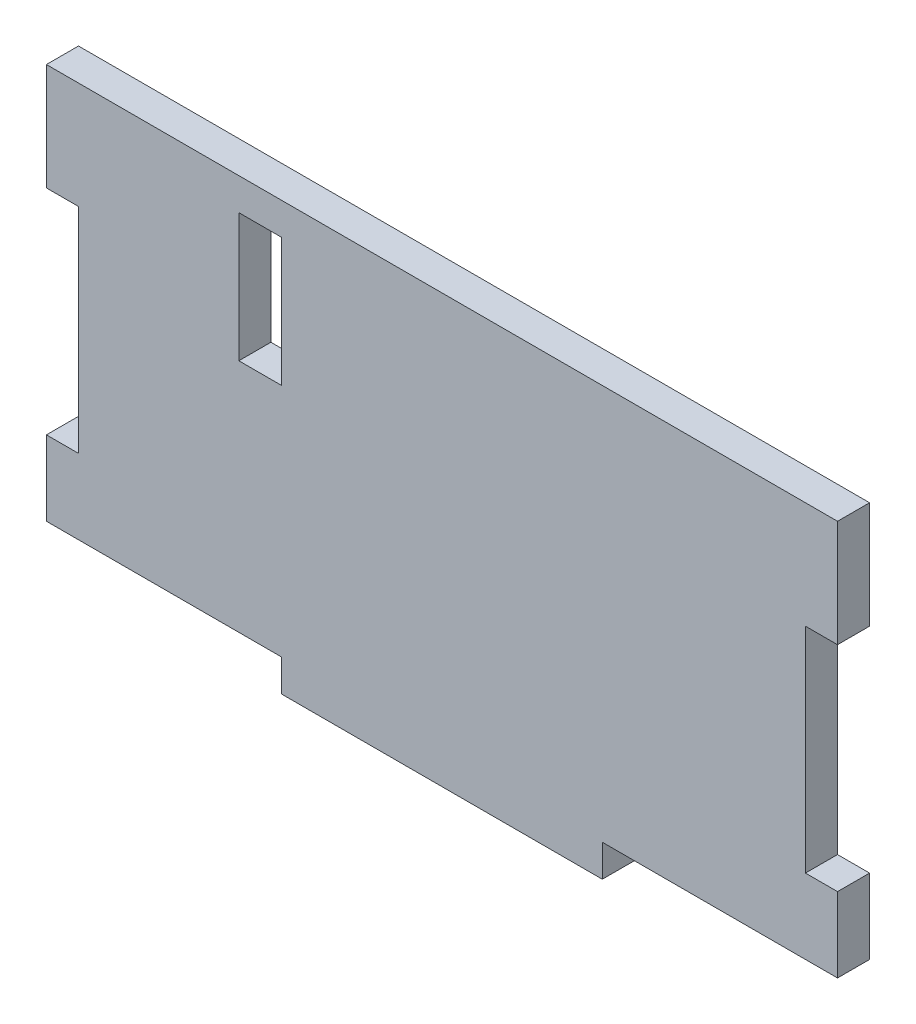
ISO-10303-21;
HEADER;
FILE_DESCRIPTION(('STEP AP214'),'2;1');
FILE_NAME('part.step','',(''),(''),'','','');
FILE_SCHEMA(('AUTOMOTIVE_DESIGN { 1 0 10303 214 1 1 1 1 }'));
ENDSEC;
DATA;
#1=APPLICATION_CONTEXT('core data for automotive mechanical design processes');
#2=APPLICATION_PROTOCOL_DEFINITION('international standard','automotive_design',2000,#1);
#3=PRODUCT_CONTEXT('',#1,'mechanical');
#4=PRODUCT('Part','Part','',(#3));
#5=PRODUCT_RELATED_PRODUCT_CATEGORY('part','',(#4));
#6=PRODUCT_DEFINITION_FORMATION('','',#4);
#7=PRODUCT_DEFINITION_CONTEXT('part definition',#1,'design');
#8=PRODUCT_DEFINITION('design','',#6,#7);
#9=PRODUCT_DEFINITION_SHAPE('','',#8);
#10=(LENGTH_UNIT() NAMED_UNIT(*) SI_UNIT(.MILLI.,.METRE.));
#11=(NAMED_UNIT(*) PLANE_ANGLE_UNIT() SI_UNIT($,.RADIAN.));
#12=(NAMED_UNIT(*) SI_UNIT($,.STERADIAN.) SOLID_ANGLE_UNIT());
#13=UNCERTAINTY_MEASURE_WITH_UNIT(LENGTH_MEASURE(1.E-05),#10,'distance_accuracy_value','');
#14=(GEOMETRIC_REPRESENTATION_CONTEXT(3) GLOBAL_UNCERTAINTY_ASSIGNED_CONTEXT((#13)) GLOBAL_UNIT_ASSIGNED_CONTEXT((#10,
#11,#12)) REPRESENTATION_CONTEXT('',''));
#15=CARTESIAN_POINT('',(0.,0.,0.));
#16=DIRECTION('',(0.,0.,1.));
#17=DIRECTION('',(1.,0.,0.));
#18=AXIS2_PLACEMENT_3D('',#15,#16,#17);
#19=CARTESIAN_POINT('',(37.,-20.,3.));
#20=DIRECTION('',(-1.,0.,0.));
#21=DIRECTION('',(0.,0.,1.));
#22=AXIS2_PLACEMENT_3D('',#19,#20,#21);
#23=PLANE('',#22);
#24=DIRECTION('',(0.,1.,0.));
#25=VECTOR('',#24,1.);
#26=CARTESIAN_POINT('',(37.,-20.,3.));
#27=LINE('',#26,#25);
#28=CARTESIAN_POINT('',(37.,10.,3.));
#29=VERTEX_POINT('',#28);
#30=CARTESIAN_POINT('',(37.,20.,3.));
#31=VERTEX_POINT('',#30);
#32=EDGE_CURVE('E292',#29,#31,#27,.T.);
#33=ORIENTED_EDGE('',*,*,#32,.F.);
#34=DIRECTION('',(0.,0.,1.));
#35=VECTOR('',#34,1.);
#36=CARTESIAN_POINT('',(37.,10.,0.));
#37=LINE('',#36,#35);
#38=CARTESIAN_POINT('',(37.,10.,0.));
#39=VERTEX_POINT('',#38);
#40=EDGE_CURVE('E201',#39,#29,#37,.T.);
#41=ORIENTED_EDGE('',*,*,#40,.F.);
#42=DIRECTION('',(0.,1.,0.));
#43=VECTOR('',#42,1.);
#44=CARTESIAN_POINT('',(37.,-20.,0.));
#45=LINE('',#44,#43);
#46=CARTESIAN_POINT('',(37.,20.,0.));
#47=VERTEX_POINT('',#46);
#48=EDGE_CURVE('E287',#39,#47,#45,.T.);
#49=ORIENTED_EDGE('',*,*,#48,.T.);
#50=DIRECTION('',(0.,0.,-1.));
#51=VECTOR('',#50,1.);
#52=CARTESIAN_POINT('',(37.,20.,3.));
#53=LINE('',#52,#51);
#54=EDGE_CURVE('E318',#31,#47,#53,.T.);
#55=ORIENTED_EDGE('',*,*,#54,.F.);
#56=EDGE_LOOP('',(#33,#41,#49,#55));
#57=FACE_BOUND('',#56,.T.);
#58=ADVANCED_FACE('F39',(#57),#23,.F.);
#59=CARTESIAN_POINT('',(-37.,-20.,3.));
#60=DIRECTION('',(1.,0.,0.));
#61=DIRECTION('',(0.,0.,-1.));
#62=AXIS2_PLACEMENT_3D('',#59,#60,#61);
#63=PLANE('',#62);
#64=DIRECTION('',(0.,-1.,0.));
#65=VECTOR('',#64,1.);
#66=CARTESIAN_POINT('',(-37.,-20.,0.));
#67=LINE('',#66,#65);
#68=CARTESIAN_POINT('',(-37.,20.,0.));
#69=VERTEX_POINT('',#68);
#70=CARTESIAN_POINT('',(-37.,10.,0.));
#71=VERTEX_POINT('',#70);
#72=EDGE_CURVE('E311',#69,#71,#67,.T.);
#73=ORIENTED_EDGE('',*,*,#72,.T.);
#74=DIRECTION('',(0.,0.,1.));
#75=VECTOR('',#74,1.);
#76=CARTESIAN_POINT('',(-37.,10.,0.));
#77=LINE('',#76,#75);
#78=CARTESIAN_POINT('',(-37.,10.,3.));
#79=VERTEX_POINT('',#78);
#80=EDGE_CURVE('E222',#71,#79,#77,.T.);
#81=ORIENTED_EDGE('',*,*,#80,.T.);
#82=DIRECTION('',(0.,-1.,0.));
#83=VECTOR('',#82,1.);
#84=CARTESIAN_POINT('',(-37.,-20.,3.));
#85=LINE('',#84,#83);
#86=CARTESIAN_POINT('',(-37.,20.,3.));
#87=VERTEX_POINT('',#86);
#88=EDGE_CURVE('E299',#87,#79,#85,.T.);
#89=ORIENTED_EDGE('',*,*,#88,.F.);
#90=DIRECTION('',(0.,0.,-1.));
#91=VECTOR('',#90,1.);
#92=CARTESIAN_POINT('',(-37.,20.,3.));
#93=LINE('',#92,#91);
#94=EDGE_CURVE('E305',#87,#69,#93,.T.);
#95=ORIENTED_EDGE('',*,*,#94,.T.);
#96=EDGE_LOOP('',(#73,#81,#89,#95));
#97=FACE_BOUND('',#96,.T.);
#98=ADVANCED_FACE('F347',(#97),#63,.F.);
#99=CARTESIAN_POINT('',(37.,-17.,3.));
#100=VERTEX_POINT('',#99);
#101=CARTESIAN_POINT('',(37.,-9.99999999999999,3.));
#102=VERTEX_POINT('',#101);
#103=EDGE_CURVE('E294',#100,#102,#27,.T.);
#104=ORIENTED_EDGE('',*,*,#103,.F.);
#105=DIRECTION('',(0.,0.,1.));
#106=VECTOR('',#105,1.);
#107=CARTESIAN_POINT('',(37.,-17.,0.));
#108=LINE('',#107,#106);
#109=CARTESIAN_POINT('',(37.,-17.,0.));
#110=VERTEX_POINT('',#109);
#111=EDGE_CURVE('E234',#110,#100,#108,.T.);
#112=ORIENTED_EDGE('',*,*,#111,.F.);
#113=CARTESIAN_POINT('',(37.,-9.99999999999999,0.));
#114=VERTEX_POINT('',#113);
#115=EDGE_CURVE('E307',#110,#114,#45,.T.);
#116=ORIENTED_EDGE('',*,*,#115,.T.);
#117=DIRECTION('',(0.,0.,1.));
#118=VECTOR('',#117,1.);
#119=CARTESIAN_POINT('',(37.,-9.99999999999999,0.));
#120=LINE('',#119,#118);
#121=EDGE_CURVE('E209',#114,#102,#120,.T.);
#122=ORIENTED_EDGE('',*,*,#121,.T.);
#123=EDGE_LOOP('',(#104,#112,#116,#122));
#124=FACE_BOUND('',#123,.T.);
#125=ADVANCED_FACE('F41',(#124),#23,.F.);
#126=CARTESIAN_POINT('',(-37.,20.,3.));
#127=DIRECTION('',(0.,-1.,0.));
#128=DIRECTION('',(0.,0.,-1.));
#129=AXIS2_PLACEMENT_3D('',#126,#127,#128);
#130=PLANE('',#129);
#131=DIRECTION('',(-1.,0.,0.));
#132=VECTOR('',#131,1.);
#133=CARTESIAN_POINT('',(-37.,20.,0.));
#134=LINE('',#133,#132);
#135=EDGE_CURVE('E308',#47,#69,#134,.T.);
#136=ORIENTED_EDGE('',*,*,#135,.T.);
#137=ORIENTED_EDGE('',*,*,#94,.F.);
#138=DIRECTION('',(-1.,0.,0.));
#139=VECTOR('',#138,1.);
#140=CARTESIAN_POINT('',(-37.,20.,3.));
#141=LINE('',#140,#139);
#142=EDGE_CURVE('E296',#31,#87,#141,.T.);
#143=ORIENTED_EDGE('',*,*,#142,.F.);
#144=ORIENTED_EDGE('',*,*,#54,.T.);
#145=EDGE_LOOP('',(#136,#137,#143,#144));
#146=FACE_BOUND('',#145,.T.);
#147=ADVANCED_FACE('F358',(#146),#130,.F.);
#148=CARTESIAN_POINT('',(-37.,-10.,3.));
#149=VERTEX_POINT('',#148);
#150=CARTESIAN_POINT('',(-37.,-17.,3.));
#151=VERTEX_POINT('',#150);
#152=EDGE_CURVE('E298',#149,#151,#85,.T.);
#153=ORIENTED_EDGE('',*,*,#152,.F.);
#154=DIRECTION('',(0.,0.,1.));
#155=VECTOR('',#154,1.);
#156=CARTESIAN_POINT('',(-37.,-10.,0.));
#157=LINE('',#156,#155);
#158=CARTESIAN_POINT('',(-37.,-10.,0.));
#159=VERTEX_POINT('',#158);
#160=EDGE_CURVE('E250',#159,#149,#157,.T.);
#161=ORIENTED_EDGE('',*,*,#160,.F.);
#162=CARTESIAN_POINT('',(-37.,-17.,0.));
#163=VERTEX_POINT('',#162);
#164=EDGE_CURVE('E310',#159,#163,#67,.T.);
#165=ORIENTED_EDGE('',*,*,#164,.T.);
#166=DIRECTION('',(0.,0.,1.));
#167=VECTOR('',#166,1.);
#168=CARTESIAN_POINT('',(-37.,-17.,0.));
#169=LINE('',#168,#167);
#170=EDGE_CURVE('E288',#163,#151,#169,.T.);
#171=ORIENTED_EDGE('',*,*,#170,.T.);
#172=EDGE_LOOP('',(#153,#161,#165,#171));
#173=FACE_BOUND('',#172,.T.);
#174=ADVANCED_FACE('F355',(#173),#63,.F.);
#175=CARTESIAN_POINT('',(-37.,-20.,3.));
#176=DIRECTION('',(0.,1.,0.));
#177=DIRECTION('',(0.,0.,1.));
#178=AXIS2_PLACEMENT_3D('',#175,#176,#177);
#179=PLANE('',#178);
#180=DIRECTION('',(1.,0.,0.));
#181=VECTOR('',#180,1.);
#182=CARTESIAN_POINT('',(-37.,-20.,0.));
#183=LINE('',#182,#181);
#184=CARTESIAN_POINT('',(-15.,-20.,0.));
#185=VERTEX_POINT('',#184);
#186=CARTESIAN_POINT('',(15.,-20.,0.));
#187=VERTEX_POINT('',#186);
#188=EDGE_CURVE('E295',#185,#187,#183,.T.);
#189=ORIENTED_EDGE('',*,*,#188,.T.);
#190=DIRECTION('',(0.,0.,1.));
#191=VECTOR('',#190,1.);
#192=CARTESIAN_POINT('',(15.,-20.,0.));
#193=LINE('',#192,#191);
#194=CARTESIAN_POINT('',(15.,-20.,3.));
#195=VERTEX_POINT('',#194);
#196=EDGE_CURVE('E230',#187,#195,#193,.T.);
#197=ORIENTED_EDGE('',*,*,#196,.T.);
#198=DIRECTION('',(1.,0.,0.));
#199=VECTOR('',#198,1.);
#200=CARTESIAN_POINT('',(-37.,-20.,3.));
#201=LINE('',#200,#199);
#202=CARTESIAN_POINT('',(-15.,-20.,3.));
#203=VERTEX_POINT('',#202);
#204=EDGE_CURVE('E302',#203,#195,#201,.T.);
#205=ORIENTED_EDGE('',*,*,#204,.F.);
#206=DIRECTION('',(0.,0.,1.));
#207=VECTOR('',#206,1.);
#208=CARTESIAN_POINT('',(-15.,-20.,0.));
#209=LINE('',#208,#207);
#210=EDGE_CURVE('E285',#185,#203,#209,.T.);
#211=ORIENTED_EDGE('',*,*,#210,.F.);
#212=EDGE_LOOP('',(#189,#197,#205,#211));
#213=FACE_BOUND('',#212,.T.);
#214=ADVANCED_FACE('F418',(#213),#179,.F.);
#215=CARTESIAN_POINT('',(0.,0.,3.));
#216=DIRECTION('',(0.,0.,-1.));
#217=DIRECTION('',(-1.,0.,0.));
#218=AXIS2_PLACEMENT_3D('',#215,#216,#217);
#219=PLANE('',#218);
#220=DIRECTION('',(1.,0.,0.));
#221=VECTOR('',#220,1.);
#222=CARTESIAN_POINT('',(-19.,5.,3.));
#223=LINE('',#222,#221);
#224=CARTESIAN_POINT('',(-19.,5.,3.));
#225=VERTEX_POINT('',#224);
#226=CARTESIAN_POINT('',(-15.,5.,3.));
#227=VERTEX_POINT('',#226);
#228=EDGE_CURVE('E187',#225,#227,#223,.T.);
#229=ORIENTED_EDGE('',*,*,#228,.F.);
#230=DIRECTION('',(0.,-1.,0.));
#231=VECTOR('',#230,1.);
#232=CARTESIAN_POINT('',(-19.,17.,3.));
#233=LINE('',#232,#231);
#234=CARTESIAN_POINT('',(-19.,17.,3.));
#235=VERTEX_POINT('',#234);
#236=EDGE_CURVE('E54',#235,#225,#233,.T.);
#237=ORIENTED_EDGE('',*,*,#236,.F.);
#238=DIRECTION('',(-1.,0.,0.));
#239=VECTOR('',#238,1.);
#240=CARTESIAN_POINT('',(-19.,17.,3.));
#241=LINE('',#240,#239);
#242=CARTESIAN_POINT('',(-15.,17.,3.));
#243=VERTEX_POINT('',#242);
#244=EDGE_CURVE('E194',#243,#235,#241,.T.);
#245=ORIENTED_EDGE('',*,*,#244,.F.);
#246=DIRECTION('',(0.,1.,0.));
#247=VECTOR('',#246,1.);
#248=CARTESIAN_POINT('',(-15.,17.,3.));
#249=LINE('',#248,#247);
#250=EDGE_CURVE('E178',#227,#243,#249,.T.);
#251=ORIENTED_EDGE('',*,*,#250,.F.);
#252=EDGE_LOOP('',(#229,#237,#245,#251));
#253=FACE_BOUND('',#252,.T.);
#254=ORIENTED_EDGE('',*,*,#204,.T.);
#255=DIRECTION('',(0.,-1.,0.));
#256=VECTOR('',#255,1.);
#257=CARTESIAN_POINT('',(15.,-17.,3.));
#258=LINE('',#257,#256);
#259=CARTESIAN_POINT('',(15.,-17.,3.));
#260=VERTEX_POINT('',#259);
#261=EDGE_CURVE('E242',#260,#195,#258,.T.);
#262=ORIENTED_EDGE('',*,*,#261,.F.);
#263=DIRECTION('',(-1.,0.,0.));
#264=VECTOR('',#263,1.);
#265=CARTESIAN_POINT('',(15.,-17.,3.));
#266=LINE('',#265,#264);
#267=EDGE_CURVE('E239',#100,#260,#266,.T.);
#268=ORIENTED_EDGE('',*,*,#267,.F.);
#269=ORIENTED_EDGE('',*,*,#103,.T.);
#270=DIRECTION('',(1.,0.,0.));
#271=VECTOR('',#270,1.);
#272=CARTESIAN_POINT('',(37.,-9.99999999999999,3.));
#273=LINE('',#272,#271);
#274=CARTESIAN_POINT('',(34.,-9.99999999999999,3.));
#275=VERTEX_POINT('',#274);
#276=EDGE_CURVE('E213',#275,#102,#273,.T.);
#277=ORIENTED_EDGE('',*,*,#276,.F.);
#278=DIRECTION('',(0.,-1.,0.));
#279=VECTOR('',#278,1.);
#280=CARTESIAN_POINT('',(34.,10.,3.));
#281=LINE('',#280,#279);
#282=CARTESIAN_POINT('',(34.,10.,3.));
#283=VERTEX_POINT('',#282);
#284=EDGE_CURVE('E215',#283,#275,#281,.T.);
#285=ORIENTED_EDGE('',*,*,#284,.F.);
#286=DIRECTION('',(-1.,0.,0.));
#287=VECTOR('',#286,1.);
#288=CARTESIAN_POINT('',(37.,10.,3.));
#289=LINE('',#288,#287);
#290=EDGE_CURVE('E219',#29,#283,#289,.T.);
#291=ORIENTED_EDGE('',*,*,#290,.F.);
#292=ORIENTED_EDGE('',*,*,#32,.T.);
#293=ORIENTED_EDGE('',*,*,#142,.T.);
#294=ORIENTED_EDGE('',*,*,#88,.T.);
#295=DIRECTION('',(-1.,0.,0.));
#296=VECTOR('',#295,1.);
#297=CARTESIAN_POINT('',(-37.,10.,3.));
#298=LINE('',#297,#296);
#299=CARTESIAN_POINT('',(-34.,10.,3.));
#300=VERTEX_POINT('',#299);
#301=EDGE_CURVE('E259',#300,#79,#298,.T.);
#302=ORIENTED_EDGE('',*,*,#301,.F.);
#303=DIRECTION('',(0.,1.,0.));
#304=VECTOR('',#303,1.);
#305=CARTESIAN_POINT('',(-34.,10.,3.));
#306=LINE('',#305,#304);
#307=CARTESIAN_POINT('',(-34.,-10.,3.));
#308=VERTEX_POINT('',#307);
#309=EDGE_CURVE('E261',#308,#300,#306,.T.);
#310=ORIENTED_EDGE('',*,*,#309,.F.);
#311=DIRECTION('',(1.,0.,0.));
#312=VECTOR('',#311,1.);
#313=CARTESIAN_POINT('',(-37.,-10.,3.));
#314=LINE('',#313,#312);
#315=EDGE_CURVE('E238',#149,#308,#314,.T.);
#316=ORIENTED_EDGE('',*,*,#315,.F.);
#317=ORIENTED_EDGE('',*,*,#152,.T.);
#318=DIRECTION('',(-1.,0.,0.));
#319=VECTOR('',#318,1.);
#320=CARTESIAN_POINT('',(-15.,-17.,3.));
#321=LINE('',#320,#319);
#322=CARTESIAN_POINT('',(-15.,-17.,3.));
#323=VERTEX_POINT('',#322);
#324=EDGE_CURVE('E278',#323,#151,#321,.T.);
#325=ORIENTED_EDGE('',*,*,#324,.F.);
#326=DIRECTION('',(0.,1.,0.));
#327=VECTOR('',#326,1.);
#328=CARTESIAN_POINT('',(-15.,-20.,3.));
#329=LINE('',#328,#327);
#330=EDGE_CURVE('E245',#203,#323,#329,.T.);
#331=ORIENTED_EDGE('',*,*,#330,.F.);
#332=EDGE_LOOP('',(#254,#262,#268,#269,#277,#285,#291,#292,#293,#294,#302,#310,#316,#317,#325,#331));
#333=FACE_BOUND('',#332,.T.);
#334=ADVANCED_FACE('F191',(#253,#333),#219,.F.);
#335=CARTESIAN_POINT('',(0.,0.,0.));
#336=DIRECTION('',(0.,0.,-1.));
#337=DIRECTION('',(-1.,0.,0.));
#338=AXIS2_PLACEMENT_3D('',#335,#336,#337);
#339=PLANE('',#338);
#340=DIRECTION('',(0.,1.,0.));
#341=VECTOR('',#340,1.);
#342=CARTESIAN_POINT('',(-19.,0.,0.));
#343=LINE('',#342,#341);
#344=CARTESIAN_POINT('',(-19.,5.,0.));
#345=VERTEX_POINT('',#344);
#346=CARTESIAN_POINT('',(-19.,17.,0.));
#347=VERTEX_POINT('',#346);
#348=EDGE_CURVE('E11',#345,#347,#343,.T.);
#349=ORIENTED_EDGE('',*,*,#348,.F.);
#350=DIRECTION('',(-1.,0.,0.));
#351=VECTOR('',#350,1.);
#352=CARTESIAN_POINT('',(0.,5.,0.));
#353=LINE('',#352,#351);
#354=CARTESIAN_POINT('',(-15.,5.,0.));
#355=VERTEX_POINT('',#354);
#356=EDGE_CURVE('E321',#355,#345,#353,.T.);
#357=ORIENTED_EDGE('',*,*,#356,.F.);
#358=DIRECTION('',(0.,-1.,0.));
#359=VECTOR('',#358,1.);
#360=CARTESIAN_POINT('',(-15.,0.,0.));
#361=LINE('',#360,#359);
#362=CARTESIAN_POINT('',(-15.,17.,0.));
#363=VERTEX_POINT('',#362);
#364=EDGE_CURVE('E181',#363,#355,#361,.T.);
#365=ORIENTED_EDGE('',*,*,#364,.F.);
#366=DIRECTION('',(1.,0.,0.));
#367=VECTOR('',#366,1.);
#368=CARTESIAN_POINT('',(0.,17.,0.));
#369=LINE('',#368,#367);
#370=EDGE_CURVE('E47',#347,#363,#369,.T.);
#371=ORIENTED_EDGE('',*,*,#370,.F.);
#372=EDGE_LOOP('',(#349,#357,#365,#371));
#373=FACE_BOUND('',#372,.T.);
#374=DIRECTION('',(0.,-1.,0.));
#375=VECTOR('',#374,1.);
#376=CARTESIAN_POINT('',(15.,-17.,0.));
#377=LINE('',#376,#375);
#378=CARTESIAN_POINT('',(15.,-17.,0.));
#379=VERTEX_POINT('',#378);
#380=EDGE_CURVE('E243',#379,#187,#377,.T.);
#381=ORIENTED_EDGE('',*,*,#380,.T.);
#382=ORIENTED_EDGE('',*,*,#188,.F.);
#383=DIRECTION('',(0.,1.,0.));
#384=VECTOR('',#383,1.);
#385=CARTESIAN_POINT('',(-15.,-20.,0.));
#386=LINE('',#385,#384);
#387=CARTESIAN_POINT('',(-15.,-17.,0.));
#388=VERTEX_POINT('',#387);
#389=EDGE_CURVE('E274',#185,#388,#386,.T.);
#390=ORIENTED_EDGE('',*,*,#389,.T.);
#391=DIRECTION('',(-1.,0.,0.));
#392=VECTOR('',#391,1.);
#393=CARTESIAN_POINT('',(-15.,-17.,0.));
#394=LINE('',#393,#392);
#395=EDGE_CURVE('E277',#388,#163,#394,.T.);
#396=ORIENTED_EDGE('',*,*,#395,.T.);
#397=ORIENTED_EDGE('',*,*,#164,.F.);
#398=DIRECTION('',(1.,0.,0.));
#399=VECTOR('',#398,1.);
#400=CARTESIAN_POINT('',(-37.,-10.,0.));
#401=LINE('',#400,#399);
#402=CARTESIAN_POINT('',(-34.,-10.,0.));
#403=VERTEX_POINT('',#402);
#404=EDGE_CURVE('E262',#159,#403,#401,.T.);
#405=ORIENTED_EDGE('',*,*,#404,.T.);
#406=DIRECTION('',(0.,1.,0.));
#407=VECTOR('',#406,1.);
#408=CARTESIAN_POINT('',(-34.,10.,0.));
#409=LINE('',#408,#407);
#410=CARTESIAN_POINT('',(-34.,10.,0.));
#411=VERTEX_POINT('',#410);
#412=EDGE_CURVE('E269',#403,#411,#409,.T.);
#413=ORIENTED_EDGE('',*,*,#412,.T.);
#414=DIRECTION('',(-1.,0.,0.));
#415=VECTOR('',#414,1.);
#416=CARTESIAN_POINT('',(-37.,10.,0.));
#417=LINE('',#416,#415);
#418=EDGE_CURVE('E252',#411,#71,#417,.T.);
#419=ORIENTED_EDGE('',*,*,#418,.T.);
#420=ORIENTED_EDGE('',*,*,#72,.F.);
#421=ORIENTED_EDGE('',*,*,#135,.F.);
#422=ORIENTED_EDGE('',*,*,#48,.F.);
#423=DIRECTION('',(-1.,0.,0.));
#424=VECTOR('',#423,1.);
#425=CARTESIAN_POINT('',(37.,10.,0.));
#426=LINE('',#425,#424);
#427=CARTESIAN_POINT('',(34.,10.,0.));
#428=VERTEX_POINT('',#427);
#429=EDGE_CURVE('E216',#39,#428,#426,.T.);
#430=ORIENTED_EDGE('',*,*,#429,.T.);
#431=DIRECTION('',(0.,-1.,0.));
#432=VECTOR('',#431,1.);
#433=CARTESIAN_POINT('',(34.,10.,0.));
#434=LINE('',#433,#432);
#435=CARTESIAN_POINT('',(34.,-9.99999999999999,0.));
#436=VERTEX_POINT('',#435);
#437=EDGE_CURVE('E225',#428,#436,#434,.T.);
#438=ORIENTED_EDGE('',*,*,#437,.T.);
#439=DIRECTION('',(1.,0.,0.));
#440=VECTOR('',#439,1.);
#441=CARTESIAN_POINT('',(37.,-9.99999999999999,0.));
#442=LINE('',#441,#440);
#443=EDGE_CURVE('E206',#436,#114,#442,.T.);
#444=ORIENTED_EDGE('',*,*,#443,.T.);
#445=ORIENTED_EDGE('',*,*,#115,.F.);
#446=DIRECTION('',(-1.,0.,0.));
#447=VECTOR('',#446,1.);
#448=CARTESIAN_POINT('',(15.,-17.,0.));
#449=LINE('',#448,#447);
#450=EDGE_CURVE('E233',#110,#379,#449,.T.);
#451=ORIENTED_EDGE('',*,*,#450,.T.);
#452=EDGE_LOOP('',(#381,#382,#390,#396,#397,#405,#413,#419,#420,#421,#422,#430,#438,#444,#445,#451));
#453=FACE_BOUND('',#452,.T.);
#454=ADVANCED_FACE('F329',(#373,#453),#339,.T.);
#455=CARTESIAN_POINT('',(-15.,-20.,0.));
#456=DIRECTION('',(1.,0.,0.));
#457=DIRECTION('',(0.,0.,-1.));
#458=AXIS2_PLACEMENT_3D('',#455,#456,#457);
#459=PLANE('',#458);
#460=ORIENTED_EDGE('',*,*,#330,.T.);
#461=DIRECTION('',(0.,0.,1.));
#462=VECTOR('',#461,1.);
#463=CARTESIAN_POINT('',(-15.,-17.,0.));
#464=LINE('',#463,#462);
#465=EDGE_CURVE('E281',#388,#323,#464,.T.);
#466=ORIENTED_EDGE('',*,*,#465,.F.);
#467=ORIENTED_EDGE('',*,*,#389,.F.);
#468=ORIENTED_EDGE('',*,*,#210,.T.);
#469=EDGE_LOOP('',(#460,#466,#467,#468));
#470=FACE_BOUND('',#469,.T.);
#471=ADVANCED_FACE('F414',(#470),#459,.F.);
#472=CARTESIAN_POINT('',(-15.,-17.,0.));
#473=DIRECTION('',(0.,1.,0.));
#474=DIRECTION('',(-1.,0.,0.));
#475=AXIS2_PLACEMENT_3D('',#472,#473,#474);
#476=PLANE('',#475);
#477=ORIENTED_EDGE('',*,*,#324,.T.);
#478=ORIENTED_EDGE('',*,*,#170,.F.);
#479=ORIENTED_EDGE('',*,*,#395,.F.);
#480=ORIENTED_EDGE('',*,*,#465,.T.);
#481=EDGE_LOOP('',(#477,#478,#479,#480));
#482=FACE_BOUND('',#481,.T.);
#483=ADVANCED_FACE('F411',(#482),#476,.F.);
#484=CARTESIAN_POINT('',(37.,10.,0.));
#485=DIRECTION('',(0.,1.,0.));
#486=DIRECTION('',(0.,0.,1.));
#487=AXIS2_PLACEMENT_3D('',#484,#485,#486);
#488=PLANE('',#487);
#489=ORIENTED_EDGE('',*,*,#290,.T.);
#490=DIRECTION('',(0.,0.,1.));
#491=VECTOR('',#490,1.);
#492=CARTESIAN_POINT('',(34.,10.,0.));
#493=LINE('',#492,#491);
#494=EDGE_CURVE('E204',#428,#283,#493,.T.);
#495=ORIENTED_EDGE('',*,*,#494,.F.);
#496=ORIENTED_EDGE('',*,*,#429,.F.);
#497=ORIENTED_EDGE('',*,*,#40,.T.);
#498=EDGE_LOOP('',(#489,#495,#496,#497));
#499=FACE_BOUND('',#498,.T.);
#500=ADVANCED_FACE('F435',(#499),#488,.F.);
#501=CARTESIAN_POINT('',(37.,-9.99999999999999,0.));
#502=DIRECTION('',(0.,-1.,0.));
#503=DIRECTION('',(0.,0.,-1.));
#504=AXIS2_PLACEMENT_3D('',#501,#502,#503);
#505=PLANE('',#504);
#506=ORIENTED_EDGE('',*,*,#276,.T.);
#507=ORIENTED_EDGE('',*,*,#121,.F.);
#508=ORIENTED_EDGE('',*,*,#443,.F.);
#509=DIRECTION('',(0.,0.,1.));
#510=VECTOR('',#509,1.);
#511=CARTESIAN_POINT('',(34.,-9.99999999999999,0.));
#512=LINE('',#511,#510);
#513=EDGE_CURVE('E207',#436,#275,#512,.T.);
#514=ORIENTED_EDGE('',*,*,#513,.T.);
#515=EDGE_LOOP('',(#506,#507,#508,#514));
#516=FACE_BOUND('',#515,.T.);
#517=ADVANCED_FACE('F378',(#516),#505,.F.);
#518=CARTESIAN_POINT('',(34.,10.,0.));
#519=DIRECTION('',(-1.,0.,0.));
#520=DIRECTION('',(0.,-1.,0.));
#521=AXIS2_PLACEMENT_3D('',#518,#519,#520);
#522=PLANE('',#521);
#523=ORIENTED_EDGE('',*,*,#284,.T.);
#524=ORIENTED_EDGE('',*,*,#513,.F.);
#525=ORIENTED_EDGE('',*,*,#437,.F.);
#526=ORIENTED_EDGE('',*,*,#494,.T.);
#527=EDGE_LOOP('',(#523,#524,#525,#526));
#528=FACE_BOUND('',#527,.T.);
#529=ADVANCED_FACE('F380',(#528),#522,.F.);
#530=CARTESIAN_POINT('',(-37.,10.,0.));
#531=DIRECTION('',(0.,1.,0.));
#532=DIRECTION('',(0.,0.,1.));
#533=AXIS2_PLACEMENT_3D('',#530,#531,#532);
#534=PLANE('',#533);
#535=ORIENTED_EDGE('',*,*,#301,.T.);
#536=ORIENTED_EDGE('',*,*,#80,.F.);
#537=ORIENTED_EDGE('',*,*,#418,.F.);
#538=DIRECTION('',(0.,0.,1.));
#539=VECTOR('',#538,1.);
#540=CARTESIAN_POINT('',(-34.,10.,0.));
#541=LINE('',#540,#539);
#542=EDGE_CURVE('E255',#411,#300,#541,.T.);
#543=ORIENTED_EDGE('',*,*,#542,.T.);
#544=EDGE_LOOP('',(#535,#536,#537,#543));
#545=FACE_BOUND('',#544,.T.);
#546=ADVANCED_FACE('F395',(#545),#534,.F.);
#547=CARTESIAN_POINT('',(-34.,10.,0.));
#548=DIRECTION('',(1.,0.,0.));
#549=DIRECTION('',(0.,0.,-1.));
#550=AXIS2_PLACEMENT_3D('',#547,#548,#549);
#551=PLANE('',#550);
#552=ORIENTED_EDGE('',*,*,#309,.T.);
#553=ORIENTED_EDGE('',*,*,#542,.F.);
#554=ORIENTED_EDGE('',*,*,#412,.F.);
#555=DIRECTION('',(0.,0.,1.));
#556=VECTOR('',#555,1.);
#557=CARTESIAN_POINT('',(-34.,-10.,0.));
#558=LINE('',#557,#556);
#559=EDGE_CURVE('E253',#403,#308,#558,.T.);
#560=ORIENTED_EDGE('',*,*,#559,.T.);
#561=EDGE_LOOP('',(#552,#553,#554,#560));
#562=FACE_BOUND('',#561,.T.);
#563=ADVANCED_FACE('F399',(#562),#551,.F.);
#564=CARTESIAN_POINT('',(-37.,-10.,0.));
#565=DIRECTION('',(0.,-1.,0.));
#566=DIRECTION('',(0.,0.,-1.));
#567=AXIS2_PLACEMENT_3D('',#564,#565,#566);
#568=PLANE('',#567);
#569=ORIENTED_EDGE('',*,*,#315,.T.);
#570=ORIENTED_EDGE('',*,*,#559,.F.);
#571=ORIENTED_EDGE('',*,*,#404,.F.);
#572=ORIENTED_EDGE('',*,*,#160,.T.);
#573=EDGE_LOOP('',(#569,#570,#571,#572));
#574=FACE_BOUND('',#573,.T.);
#575=ADVANCED_FACE('F401',(#574),#568,.F.);
#576=CARTESIAN_POINT('',(15.,-17.,0.));
#577=DIRECTION('',(-1.,0.,0.));
#578=DIRECTION('',(0.,-1.,0.));
#579=AXIS2_PLACEMENT_3D('',#576,#577,#578);
#580=PLANE('',#579);
#581=ORIENTED_EDGE('',*,*,#261,.T.);
#582=ORIENTED_EDGE('',*,*,#196,.F.);
#583=ORIENTED_EDGE('',*,*,#380,.F.);
#584=DIRECTION('',(0.,0.,1.));
#585=VECTOR('',#584,1.);
#586=CARTESIAN_POINT('',(15.,-17.,0.));
#587=LINE('',#586,#585);
#588=EDGE_CURVE('E236',#379,#260,#587,.T.);
#589=ORIENTED_EDGE('',*,*,#588,.T.);
#590=EDGE_LOOP('',(#581,#582,#583,#589));
#591=FACE_BOUND('',#590,.T.);
#592=ADVANCED_FACE('F341',(#591),#580,.F.);
#593=CARTESIAN_POINT('',(15.,-17.,0.));
#594=DIRECTION('',(0.,1.,0.));
#595=DIRECTION('',(-1.,0.,0.));
#596=AXIS2_PLACEMENT_3D('',#593,#594,#595);
#597=PLANE('',#596);
#598=ORIENTED_EDGE('',*,*,#267,.T.);
#599=ORIENTED_EDGE('',*,*,#588,.F.);
#600=ORIENTED_EDGE('',*,*,#450,.F.);
#601=ORIENTED_EDGE('',*,*,#111,.T.);
#602=EDGE_LOOP('',(#598,#599,#600,#601));
#603=FACE_BOUND('',#602,.T.);
#604=ADVANCED_FACE('F333',(#603),#597,.F.);
#605=CARTESIAN_POINT('',(-19.,17.,-7.));
#606=DIRECTION('',(-1.,0.,0.));
#607=DIRECTION('',(0.,-1.,0.));
#608=AXIS2_PLACEMENT_3D('',#605,#606,#607);
#609=PLANE('',#608);
#610=ORIENTED_EDGE('',*,*,#348,.T.);
#611=DIRECTION('',(0.,0.,1.));
#612=VECTOR('',#611,1.);
#613=CARTESIAN_POINT('',(-19.,17.,-7.));
#614=LINE('',#613,#612);
#615=EDGE_CURVE('E199',#347,#235,#614,.T.);
#616=ORIENTED_EDGE('',*,*,#615,.T.);
#617=ORIENTED_EDGE('',*,*,#236,.T.);
#618=DIRECTION('',(0.,0.,1.));
#619=VECTOR('',#618,1.);
#620=CARTESIAN_POINT('',(-19.,5.,-7.));
#621=LINE('',#620,#619);
#622=EDGE_CURVE('E184',#345,#225,#621,.T.);
#623=ORIENTED_EDGE('',*,*,#622,.F.);
#624=EDGE_LOOP('',(#610,#616,#617,#623));
#625=FACE_BOUND('',#624,.T.);
#626=ADVANCED_FACE('F331',(#625),#609,.F.);
#627=CARTESIAN_POINT('',(-19.,17.,-7.));
#628=DIRECTION('',(0.,1.,0.));
#629=DIRECTION('',(0.,0.,1.));
#630=AXIS2_PLACEMENT_3D('',#627,#628,#629);
#631=PLANE('',#630);
#632=ORIENTED_EDGE('',*,*,#370,.T.);
#633=DIRECTION('',(0.,0.,1.));
#634=VECTOR('',#633,1.);
#635=CARTESIAN_POINT('',(-15.,17.,-7.));
#636=LINE('',#635,#634);
#637=EDGE_CURVE('E183',#363,#243,#636,.T.);
#638=ORIENTED_EDGE('',*,*,#637,.T.);
#639=ORIENTED_EDGE('',*,*,#244,.T.);
#640=ORIENTED_EDGE('',*,*,#615,.F.);
#641=EDGE_LOOP('',(#632,#638,#639,#640));
#642=FACE_BOUND('',#641,.T.);
#643=ADVANCED_FACE('F326',(#642),#631,.F.);
#644=CARTESIAN_POINT('',(-15.,17.,-7.));
#645=DIRECTION('',(1.,0.,0.));
#646=DIRECTION('',(0.,0.,-1.));
#647=AXIS2_PLACEMENT_3D('',#644,#645,#646);
#648=PLANE('',#647);
#649=ORIENTED_EDGE('',*,*,#364,.T.);
#650=DIRECTION('',(0.,0.,1.));
#651=VECTOR('',#650,1.);
#652=CARTESIAN_POINT('',(-15.,5.,-7.));
#653=LINE('',#652,#651);
#654=EDGE_CURVE('E62',#355,#227,#653,.T.);
#655=ORIENTED_EDGE('',*,*,#654,.T.);
#656=ORIENTED_EDGE('',*,*,#250,.T.);
#657=ORIENTED_EDGE('',*,*,#637,.F.);
#658=EDGE_LOOP('',(#649,#655,#656,#657));
#659=FACE_BOUND('',#658,.T.);
#660=ADVANCED_FACE('F175',(#659),#648,.F.);
#661=CARTESIAN_POINT('',(-19.,5.,-7.));
#662=DIRECTION('',(0.,-1.,0.));
#663=DIRECTION('',(0.,0.,-1.));
#664=AXIS2_PLACEMENT_3D('',#661,#662,#663);
#665=PLANE('',#664);
#666=ORIENTED_EDGE('',*,*,#356,.T.);
#667=ORIENTED_EDGE('',*,*,#622,.T.);
#668=ORIENTED_EDGE('',*,*,#228,.T.);
#669=ORIENTED_EDGE('',*,*,#654,.F.);
#670=EDGE_LOOP('',(#666,#667,#668,#669));
#671=FACE_BOUND('',#670,.T.);
#672=ADVANCED_FACE('F188',(#671),#665,.F.);
#673=CLOSED_SHELL('',(#58,#98,#125,#147,#174,#214,#334,#454,#471,#483,#500,#517,#529,#546,#563,
#575,#592,#604,#626,#643,#660,#672));
#674=MANIFOLD_SOLID_BREP('B2',#673);
#675=ADVANCED_BREP_SHAPE_REPRESENTATION('',(#18,#674),#14);
#676=SHAPE_DEFINITION_REPRESENTATION(#9,#675);
ENDSEC;
END-ISO-10303-21;
